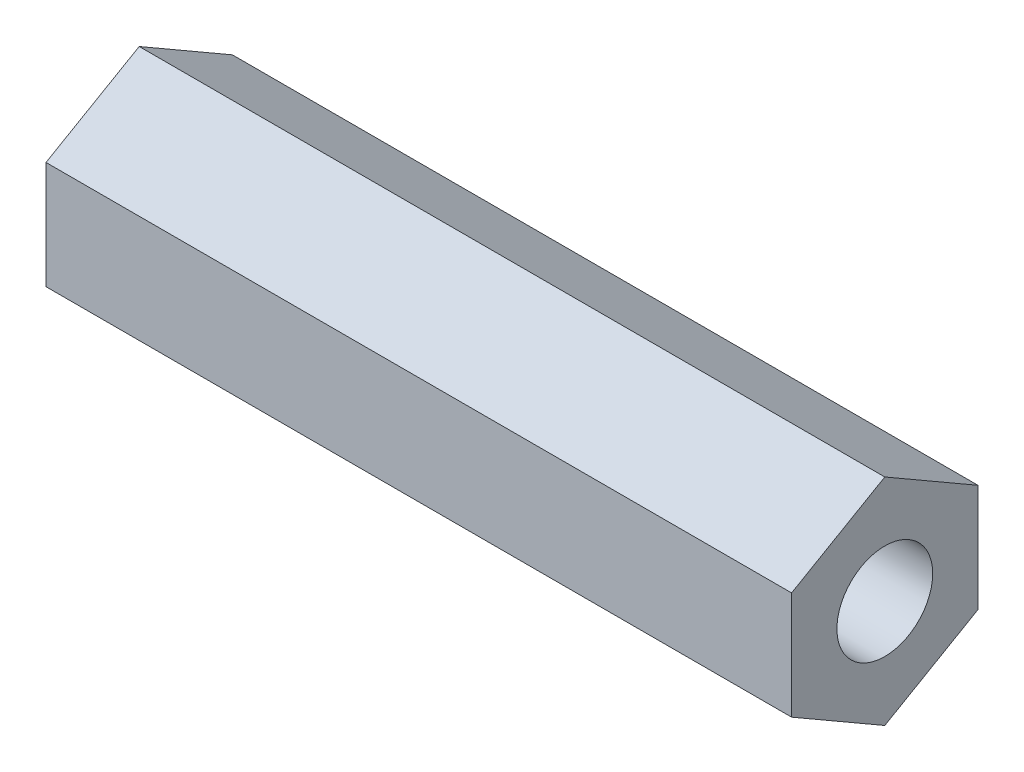
ISO-10303-21;
HEADER;
FILE_DESCRIPTION(('STEP AP214'),'2;1');
FILE_NAME('part.step','',(''),(''),'','','');
FILE_SCHEMA(('AUTOMOTIVE_DESIGN { 1 0 10303 214 1 1 1 1 }'));
ENDSEC;
DATA;
#1=APPLICATION_CONTEXT('core data for automotive mechanical design processes');
#2=APPLICATION_PROTOCOL_DEFINITION('international standard','automotive_design',2000,#1);
#3=PRODUCT_CONTEXT('',#1,'mechanical');
#4=PRODUCT('Part','Part','',(#3));
#5=PRODUCT_RELATED_PRODUCT_CATEGORY('part','',(#4));
#6=PRODUCT_DEFINITION_FORMATION('','',#4);
#7=PRODUCT_DEFINITION_CONTEXT('part definition',#1,'design');
#8=PRODUCT_DEFINITION('design','',#6,#7);
#9=PRODUCT_DEFINITION_SHAPE('','',#8);
#10=(LENGTH_UNIT() NAMED_UNIT(*) SI_UNIT(.MILLI.,.METRE.));
#11=(NAMED_UNIT(*) PLANE_ANGLE_UNIT() SI_UNIT($,.RADIAN.));
#12=(NAMED_UNIT(*) SI_UNIT($,.STERADIAN.) SOLID_ANGLE_UNIT());
#13=UNCERTAINTY_MEASURE_WITH_UNIT(LENGTH_MEASURE(1.E-05),#10,'distance_accuracy_value','');
#14=(GEOMETRIC_REPRESENTATION_CONTEXT(3) GLOBAL_UNCERTAINTY_ASSIGNED_CONTEXT((#13)) GLOBAL_UNIT_ASSIGNED_CONTEXT((#10,
#11,#12)) REPRESENTATION_CONTEXT('',''));
#15=CARTESIAN_POINT('',(0.,0.,0.));
#16=DIRECTION('',(0.,0.,1.));
#17=DIRECTION('',(1.,0.,0.));
#18=AXIS2_PLACEMENT_3D('',#15,#16,#17);
#19=CARTESIAN_POINT('',(50.8,0.,0.));
#20=DIRECTION('',(1.,0.,0.));
#21=DIRECTION('',(0.,0.,-1.));
#22=AXIS2_PLACEMENT_3D('',#19,#20,#21);
#23=PLANE('',#22);
#24=DIRECTION('',(0.,0.499999999999995,0.866025403784441));
#25=VECTOR('',#24,1.);
#26=CARTESIAN_POINT('',(50.8,3.66617420935419,-6.34999999999995));
#27=LINE('',#26,#25);
#28=CARTESIAN_POINT('',(50.8,3.66617420935419,-6.34999999999995));
#29=VERTEX_POINT('',#28);
#30=CARTESIAN_POINT('',(50.8,7.33234841870824,0.));
#31=VERTEX_POINT('',#30);
#32=EDGE_CURVE('E146',#29,#31,#27,.T.);
#33=ORIENTED_EDGE('',*,*,#32,.T.);
#34=DIRECTION('',(0.,-0.500000000000001,0.866025403784438));
#35=VECTOR('',#34,1.);
#36=CARTESIAN_POINT('',(50.8,7.33234841870824,0.));
#37=LINE('',#36,#35);
#38=CARTESIAN_POINT('',(50.8,3.6661742093541,6.35));
#39=VERTEX_POINT('',#38);
#40=EDGE_CURVE('E94',#31,#39,#37,.T.);
#41=ORIENTED_EDGE('',*,*,#40,.T.);
#42=DIRECTION('',(0.,-1.,0.));
#43=VECTOR('',#42,1.);
#44=CARTESIAN_POINT('',(50.8,3.6661742093541,6.35));
#45=LINE('',#44,#43);
#46=CARTESIAN_POINT('',(50.8,-3.66617420935415,6.34999999999997));
#47=VERTEX_POINT('',#46);
#48=EDGE_CURVE('E107',#39,#47,#45,.T.);
#49=ORIENTED_EDGE('',*,*,#48,.T.);
#50=DIRECTION('',(0.,-0.499999999999995,-0.866025403784442));
#51=VECTOR('',#50,1.);
#52=CARTESIAN_POINT('',(50.8,-3.66617420935415,6.34999999999997));
#53=LINE('',#52,#51);
#54=CARTESIAN_POINT('',(50.8,-7.33234841870823,0.));
#55=VERTEX_POINT('',#54);
#56=EDGE_CURVE('E101',#47,#55,#53,.T.);
#57=ORIENTED_EDGE('',*,*,#56,.T.);
#58=DIRECTION('',(0.,0.500000000000007,-0.866025403784435));
#59=VECTOR('',#58,1.);
#60=CARTESIAN_POINT('',(50.8,-7.33234841870823,0.));
#61=LINE('',#60,#59);
#62=CARTESIAN_POINT('',(50.8,-3.66617420935406,-6.35000000000002));
#63=VERTEX_POINT('',#62);
#64=EDGE_CURVE('E105',#55,#63,#61,.T.);
#65=ORIENTED_EDGE('',*,*,#64,.T.);
#66=DIRECTION('',(0.,1.,0.));
#67=VECTOR('',#66,1.);
#68=CARTESIAN_POINT('',(50.8,-3.66617420935406,-6.35000000000002));
#69=LINE('',#68,#67);
#70=EDGE_CURVE('E57',#63,#29,#69,.T.);
#71=ORIENTED_EDGE('',*,*,#70,.T.);
#72=EDGE_LOOP('',(#33,#41,#49,#57,#65,#71));
#73=FACE_BOUND('',#72,.T.);
#74=CARTESIAN_POINT('',(50.8,0.,0.));
#75=DIRECTION('',(1.,0.,0.));
#76=DIRECTION('',(0.,0.,-1.));
#77=AXIS2_PLACEMENT_3D('',#74,#75,#76);
#78=CIRCLE('',#77,3.2639);
#79=CARTESIAN_POINT('',(50.8,0.,-3.2639));
#80=VERTEX_POINT('',#79);
#81=EDGE_CURVE('E134',#80,#80,#78,.T.);
#82=ORIENTED_EDGE('',*,*,#81,.F.);
#83=EDGE_LOOP('',(#82));
#84=FACE_BOUND('',#83,.T.);
#85=ADVANCED_FACE('F39',(#73,#84),#23,.T.);
#86=CARTESIAN_POINT('',(0.,0.,0.));
#87=DIRECTION('',(1.,0.,0.));
#88=DIRECTION('',(0.,0.,-1.));
#89=AXIS2_PLACEMENT_3D('',#86,#87,#88);
#90=PLANE('',#89);
#91=DIRECTION('',(0.,0.499999999999995,0.866025403784441));
#92=VECTOR('',#91,1.);
#93=CARTESIAN_POINT('',(0.,3.66617420935419,-6.34999999999995));
#94=LINE('',#93,#92);
#95=CARTESIAN_POINT('',(0.,3.66617420935419,-6.34999999999995));
#96=VERTEX_POINT('',#95);
#97=CARTESIAN_POINT('',(0.,7.33234841870824,0.));
#98=VERTEX_POINT('',#97);
#99=EDGE_CURVE('E129',#96,#98,#94,.T.);
#100=ORIENTED_EDGE('',*,*,#99,.F.);
#101=DIRECTION('',(0.,1.,0.));
#102=VECTOR('',#101,1.);
#103=CARTESIAN_POINT('',(0.,-3.66617420935406,-6.35000000000002));
#104=LINE('',#103,#102);
#105=CARTESIAN_POINT('',(0.,-3.66617420935406,-6.35000000000002));
#106=VERTEX_POINT('',#105);
#107=EDGE_CURVE('E86',#106,#96,#104,.T.);
#108=ORIENTED_EDGE('',*,*,#107,.F.);
#109=DIRECTION('',(0.,0.500000000000007,-0.866025403784435));
#110=VECTOR('',#109,1.);
#111=CARTESIAN_POINT('',(0.,-7.33234841870823,0.));
#112=LINE('',#111,#110);
#113=CARTESIAN_POINT('',(0.,-7.33234841870823,0.));
#114=VERTEX_POINT('',#113);
#115=EDGE_CURVE('E80',#114,#106,#112,.T.);
#116=ORIENTED_EDGE('',*,*,#115,.F.);
#117=DIRECTION('',(0.,-0.499999999999995,-0.866025403784442));
#118=VECTOR('',#117,1.);
#119=CARTESIAN_POINT('',(0.,-3.66617420935415,6.34999999999997));
#120=LINE('',#119,#118);
#121=CARTESIAN_POINT('',(0.,-3.66617420935415,6.34999999999997));
#122=VERTEX_POINT('',#121);
#123=EDGE_CURVE('E116',#122,#114,#120,.T.);
#124=ORIENTED_EDGE('',*,*,#123,.F.);
#125=DIRECTION('',(0.,-1.,0.));
#126=VECTOR('',#125,1.);
#127=CARTESIAN_POINT('',(0.,3.6661742093541,6.35));
#128=LINE('',#127,#126);
#129=CARTESIAN_POINT('',(0.,3.6661742093541,6.35));
#130=VERTEX_POINT('',#129);
#131=EDGE_CURVE('E137',#130,#122,#128,.T.);
#132=ORIENTED_EDGE('',*,*,#131,.F.);
#133=DIRECTION('',(0.,-0.500000000000001,0.866025403784438));
#134=VECTOR('',#133,1.);
#135=CARTESIAN_POINT('',(0.,7.33234841870824,0.));
#136=LINE('',#135,#134);
#137=EDGE_CURVE('E133',#98,#130,#136,.T.);
#138=ORIENTED_EDGE('',*,*,#137,.F.);
#139=EDGE_LOOP('',(#100,#108,#116,#124,#132,#138));
#140=FACE_BOUND('',#139,.T.);
#141=CARTESIAN_POINT('',(0.,0.,0.));
#142=DIRECTION('',(1.,0.,0.));
#143=DIRECTION('',(0.,0.,-1.));
#144=AXIS2_PLACEMENT_3D('',#141,#142,#143);
#145=CIRCLE('',#144,3.2639);
#146=CARTESIAN_POINT('',(0.,0.,-3.2639));
#147=VERTEX_POINT('',#146);
#148=EDGE_CURVE('E243',#147,#147,#145,.T.);
#149=ORIENTED_EDGE('',*,*,#148,.T.);
#150=EDGE_LOOP('',(#149));
#151=FACE_BOUND('',#150,.T.);
#152=ADVANCED_FACE('F159',(#140,#151),#90,.F.);
#153=CARTESIAN_POINT('',(50.8,3.66617420935419,-6.34999999999995));
#154=DIRECTION('',(0.,-0.866025403784441,0.499999999999995));
#155=DIRECTION('',(0.,-0.499999999999995,-0.866025403784441));
#156=AXIS2_PLACEMENT_3D('',#153,#154,#155);
#157=PLANE('',#156);
#158=ORIENTED_EDGE('',*,*,#99,.T.);
#159=DIRECTION('',(-1.,0.,0.));
#160=VECTOR('',#159,1.);
#161=CARTESIAN_POINT('',(50.8,7.33234841870824,0.));
#162=LINE('',#161,#160);
#163=EDGE_CURVE('E11',#31,#98,#162,.T.);
#164=ORIENTED_EDGE('',*,*,#163,.F.);
#165=ORIENTED_EDGE('',*,*,#32,.F.);
#166=DIRECTION('',(-1.,0.,0.));
#167=VECTOR('',#166,1.);
#168=CARTESIAN_POINT('',(50.8,3.66617420935419,-6.34999999999995));
#169=LINE('',#168,#167);
#170=EDGE_CURVE('E125',#29,#96,#169,.T.);
#171=ORIENTED_EDGE('',*,*,#170,.T.);
#172=EDGE_LOOP('',(#158,#164,#165,#171));
#173=FACE_BOUND('',#172,.T.);
#174=ADVANCED_FACE('F41',(#173),#157,.F.);
#175=CARTESIAN_POINT('',(50.8,7.33234841870824,0.));
#176=DIRECTION('',(0.,-0.866025403784438,-0.500000000000001));
#177=DIRECTION('',(0.,0.500000000000001,-0.866025403784438));
#178=AXIS2_PLACEMENT_3D('',#175,#176,#177);
#179=PLANE('',#178);
#180=ORIENTED_EDGE('',*,*,#137,.T.);
#181=DIRECTION('',(-1.,0.,0.));
#182=VECTOR('',#181,1.);
#183=CARTESIAN_POINT('',(50.8,3.6661742093541,6.35));
#184=LINE('',#183,#182);
#185=EDGE_CURVE('E49',#39,#130,#184,.T.);
#186=ORIENTED_EDGE('',*,*,#185,.F.);
#187=ORIENTED_EDGE('',*,*,#40,.F.);
#188=ORIENTED_EDGE('',*,*,#163,.T.);
#189=EDGE_LOOP('',(#180,#186,#187,#188));
#190=FACE_BOUND('',#189,.T.);
#191=ADVANCED_FACE('F184',(#190),#179,.F.);
#192=CARTESIAN_POINT('',(50.8,3.6661742093541,6.35));
#193=DIRECTION('',(0.,0.,-1.));
#194=DIRECTION('',(0.,1.,0.));
#195=AXIS2_PLACEMENT_3D('',#192,#193,#194);
#196=PLANE('',#195);
#197=ORIENTED_EDGE('',*,*,#131,.T.);
#198=DIRECTION('',(-1.,0.,0.));
#199=VECTOR('',#198,1.);
#200=CARTESIAN_POINT('',(50.8,-3.66617420935415,6.34999999999997));
#201=LINE('',#200,#199);
#202=EDGE_CURVE('E118',#47,#122,#201,.T.);
#203=ORIENTED_EDGE('',*,*,#202,.F.);
#204=ORIENTED_EDGE('',*,*,#48,.F.);
#205=ORIENTED_EDGE('',*,*,#185,.T.);
#206=EDGE_LOOP('',(#197,#203,#204,#205));
#207=FACE_BOUND('',#206,.T.);
#208=ADVANCED_FACE('F156',(#207),#196,.F.);
#209=CARTESIAN_POINT('',(50.8,-3.66617420935415,6.34999999999997));
#210=DIRECTION('',(0.,0.866025403784442,-0.499999999999995));
#211=DIRECTION('',(0.,0.499999999999995,0.866025403784442));
#212=AXIS2_PLACEMENT_3D('',#209,#210,#211);
#213=PLANE('',#212);
#214=ORIENTED_EDGE('',*,*,#123,.T.);
#215=DIRECTION('',(-1.,0.,0.));
#216=VECTOR('',#215,1.);
#217=CARTESIAN_POINT('',(50.8,-7.33234841870823,0.));
#218=LINE('',#217,#216);
#219=EDGE_CURVE('E113',#55,#114,#218,.T.);
#220=ORIENTED_EDGE('',*,*,#219,.F.);
#221=ORIENTED_EDGE('',*,*,#56,.F.);
#222=ORIENTED_EDGE('',*,*,#202,.T.);
#223=EDGE_LOOP('',(#214,#220,#221,#222));
#224=FACE_BOUND('',#223,.T.);
#225=ADVANCED_FACE('F114',(#224),#213,.F.);
#226=CARTESIAN_POINT('',(50.8,-7.33234841870823,0.));
#227=DIRECTION('',(0.,0.866025403784434,0.500000000000007));
#228=DIRECTION('',(0.,-0.500000000000007,0.866025403784435));
#229=AXIS2_PLACEMENT_3D('',#226,#227,#228);
#230=PLANE('',#229);
#231=ORIENTED_EDGE('',*,*,#115,.T.);
#232=DIRECTION('',(-1.,0.,0.));
#233=VECTOR('',#232,1.);
#234=CARTESIAN_POINT('',(50.8,-3.66617420935406,-6.35000000000002));
#235=LINE('',#234,#233);
#236=EDGE_CURVE('E119',#63,#106,#235,.T.);
#237=ORIENTED_EDGE('',*,*,#236,.F.);
#238=ORIENTED_EDGE('',*,*,#64,.F.);
#239=ORIENTED_EDGE('',*,*,#219,.T.);
#240=EDGE_LOOP('',(#231,#237,#238,#239));
#241=FACE_BOUND('',#240,.T.);
#242=ADVANCED_FACE('F121',(#241),#230,.F.);
#243=CARTESIAN_POINT('',(50.8,-3.66617420935406,-6.35000000000002));
#244=DIRECTION('',(0.,0.,1.));
#245=DIRECTION('',(0.,-1.,0.));
#246=AXIS2_PLACEMENT_3D('',#243,#244,#245);
#247=PLANE('',#246);
#248=ORIENTED_EDGE('',*,*,#107,.T.);
#249=ORIENTED_EDGE('',*,*,#170,.F.);
#250=ORIENTED_EDGE('',*,*,#70,.F.);
#251=ORIENTED_EDGE('',*,*,#236,.T.);
#252=EDGE_LOOP('',(#248,#249,#250,#251));
#253=FACE_BOUND('',#252,.T.);
#254=ADVANCED_FACE('F164',(#253),#247,.F.);
#255=CARTESIAN_POINT('',(50.8,0.,0.));
#256=DIRECTION('',(-1.,0.,0.));
#257=DIRECTION('',(0.,0.,1.));
#258=AXIS2_PLACEMENT_3D('',#255,#256,#257);
#259=CYLINDRICAL_SURFACE('',#258,3.2639);
#260=ORIENTED_EDGE('',*,*,#81,.T.);
#261=EDGE_LOOP('',(#260));
#262=FACE_BOUND('',#261,.T.);
#263=ORIENTED_EDGE('',*,*,#148,.F.);
#264=EDGE_LOOP('',(#263));
#265=FACE_BOUND('',#264,.T.);
#266=ADVANCED_FACE('F166',(#262,#265),#259,.F.);
#267=CLOSED_SHELL('',(#85,#152,#174,#191,#208,#225,#242,#254,#266));
#268=MANIFOLD_SOLID_BREP('B2',#267);
#269=ADVANCED_BREP_SHAPE_REPRESENTATION('',(#18,#268),#14);
#270=SHAPE_DEFINITION_REPRESENTATION(#9,#269);
ENDSEC;
END-ISO-10303-21;
